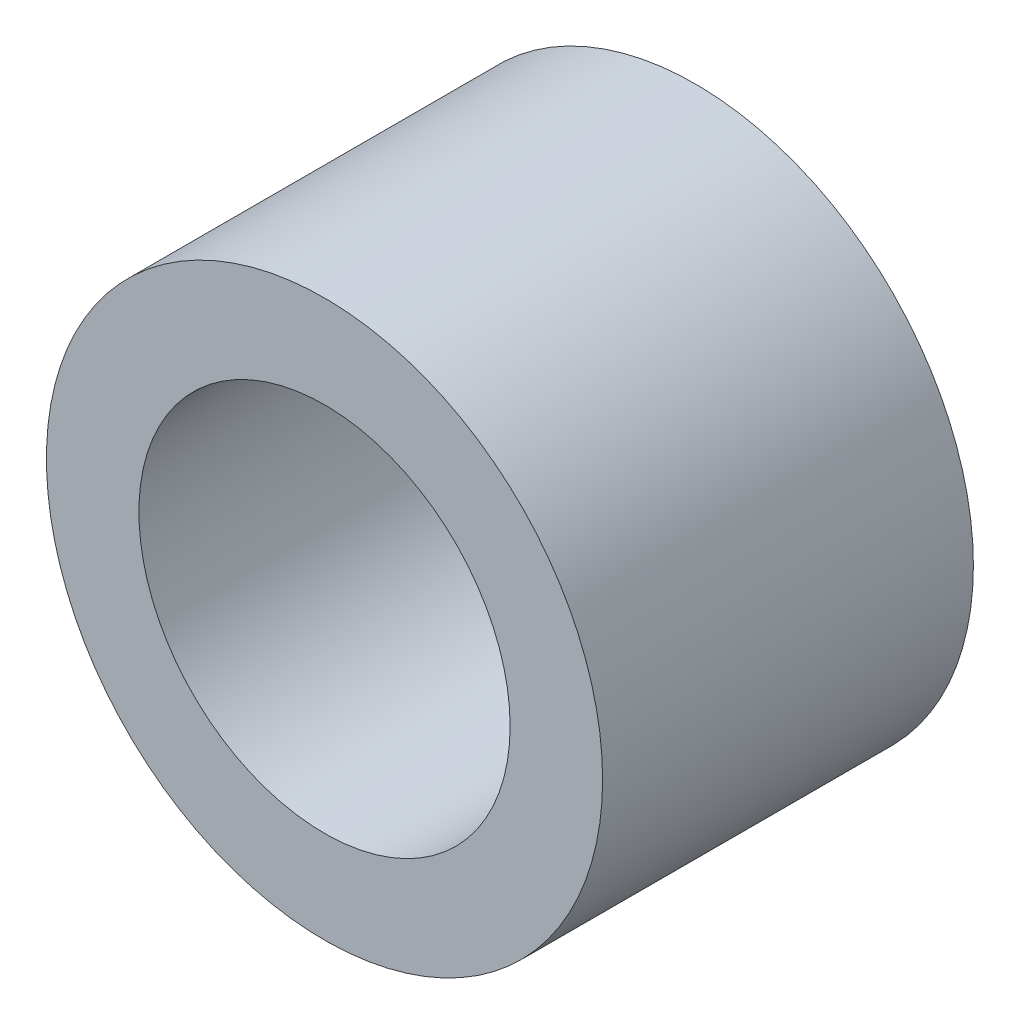
ISO-10303-21;
HEADER;
FILE_DESCRIPTION(('STEP AP214'),'2;1');
FILE_NAME('part.step','',(''),(''),'','','');
FILE_SCHEMA(('AUTOMOTIVE_DESIGN { 1 0 10303 214 1 1 1 1 }'));
ENDSEC;
DATA;
#1=APPLICATION_CONTEXT('core data for automotive mechanical design processes');
#2=APPLICATION_PROTOCOL_DEFINITION('international standard','automotive_design',2000,#1);
#3=PRODUCT_CONTEXT('',#1,'mechanical');
#4=PRODUCT('Part','Part','',(#3));
#5=PRODUCT_RELATED_PRODUCT_CATEGORY('part','',(#4));
#6=PRODUCT_DEFINITION_FORMATION('','',#4);
#7=PRODUCT_DEFINITION_CONTEXT('part definition',#1,'design');
#8=PRODUCT_DEFINITION('design','',#6,#7);
#9=PRODUCT_DEFINITION_SHAPE('','',#8);
#10=(LENGTH_UNIT() NAMED_UNIT(*) SI_UNIT(.MILLI.,.METRE.));
#11=(NAMED_UNIT(*) PLANE_ANGLE_UNIT() SI_UNIT($,.RADIAN.));
#12=(NAMED_UNIT(*) SI_UNIT($,.STERADIAN.) SOLID_ANGLE_UNIT());
#13=UNCERTAINTY_MEASURE_WITH_UNIT(LENGTH_MEASURE(1.E-05),#10,'distance_accuracy_value','');
#14=(GEOMETRIC_REPRESENTATION_CONTEXT(3) GLOBAL_UNCERTAINTY_ASSIGNED_CONTEXT((#13)) GLOBAL_UNIT_ASSIGNED_CONTEXT((#10,
#11,#12)) REPRESENTATION_CONTEXT('',''));
#15=CARTESIAN_POINT('',(0.,0.,0.));
#16=DIRECTION('',(0.,0.,1.));
#17=DIRECTION('',(1.,0.,0.));
#18=AXIS2_PLACEMENT_3D('',#15,#16,#17);
#19=CARTESIAN_POINT('',(0.,0.,-3.175));
#20=DIRECTION('',(0.,0.,1.));
#21=DIRECTION('',(1.,0.,0.));
#22=AXIS2_PLACEMENT_3D('',#19,#20,#21);
#23=CYLINDRICAL_SURFACE('',#22,4.7625);
#24=CARTESIAN_POINT('',(0.,0.,-3.175));
#25=DIRECTION('',(0.,0.,1.));
#26=DIRECTION('',(1.,0.,0.));
#27=AXIS2_PLACEMENT_3D('',#24,#25,#26);
#28=CIRCLE('',#27,4.7625);
#29=CARTESIAN_POINT('',(4.7625,0.,-3.175));
#30=VERTEX_POINT('',#29);
#31=EDGE_CURVE('E10',#30,#30,#28,.T.);
#32=ORIENTED_EDGE('',*,*,#31,.T.);
#33=EDGE_LOOP('',(#32));
#34=FACE_BOUND('',#33,.T.);
#35=CARTESIAN_POINT('',(0.,0.,3.175));
#36=DIRECTION('',(0.,0.,1.));
#37=DIRECTION('',(1.,0.,0.));
#38=AXIS2_PLACEMENT_3D('',#35,#36,#37);
#39=CIRCLE('',#38,4.7625);
#40=CARTESIAN_POINT('',(4.7625,0.,3.175));
#41=VERTEX_POINT('',#40);
#42=EDGE_CURVE('E47',#41,#41,#39,.T.);
#43=ORIENTED_EDGE('',*,*,#42,.F.);
#44=EDGE_LOOP('',(#43));
#45=FACE_BOUND('',#44,.T.);
#46=ADVANCED_FACE('F37',(#34,#45),#23,.T.);
#47=CARTESIAN_POINT('',(0.,0.,-3.175));
#48=DIRECTION('',(0.,0.,1.));
#49=DIRECTION('',(1.,0.,0.));
#50=AXIS2_PLACEMENT_3D('',#47,#48,#49);
#51=PLANE('',#50);
#52=CARTESIAN_POINT('',(0.,0.,-3.175));
#53=DIRECTION('',(0.,0.,1.));
#54=DIRECTION('',(1.,0.,0.));
#55=AXIS2_PLACEMENT_3D('',#52,#53,#54);
#56=CIRCLE('',#55,3.17881);
#57=CARTESIAN_POINT('',(3.17881,0.,-3.175));
#58=VERTEX_POINT('',#57);
#59=EDGE_CURVE('E43',#58,#58,#56,.T.);
#60=ORIENTED_EDGE('',*,*,#59,.T.);
#61=EDGE_LOOP('',(#60));
#62=FACE_BOUND('',#61,.T.);
#63=ORIENTED_EDGE('',*,*,#31,.F.);
#64=EDGE_LOOP('',(#63));
#65=FACE_BOUND('',#64,.T.);
#66=ADVANCED_FACE('F66',(#62,#65),#51,.F.);
#67=CARTESIAN_POINT('',(0.,0.,-3.175));
#68=DIRECTION('',(0.,0.,1.));
#69=DIRECTION('',(1.,0.,0.));
#70=AXIS2_PLACEMENT_3D('',#67,#68,#69);
#71=CYLINDRICAL_SURFACE('',#70,3.17881);
#72=ORIENTED_EDGE('',*,*,#59,.F.);
#73=EDGE_LOOP('',(#72));
#74=FACE_BOUND('',#73,.T.);
#75=CARTESIAN_POINT('',(0.,0.,3.175));
#76=DIRECTION('',(0.,0.,1.));
#77=DIRECTION('',(1.,0.,0.));
#78=AXIS2_PLACEMENT_3D('',#75,#76,#77);
#79=CIRCLE('',#78,3.17881);
#80=CARTESIAN_POINT('',(3.17881,0.,3.175));
#81=VERTEX_POINT('',#80);
#82=EDGE_CURVE('E51',#81,#81,#79,.T.);
#83=ORIENTED_EDGE('',*,*,#82,.T.);
#84=EDGE_LOOP('',(#83));
#85=FACE_BOUND('',#84,.T.);
#86=ADVANCED_FACE('F57',(#74,#85),#71,.F.);
#87=CARTESIAN_POINT('',(0.,0.,3.175));
#88=DIRECTION('',(0.,0.,1.));
#89=DIRECTION('',(1.,0.,0.));
#90=AXIS2_PLACEMENT_3D('',#87,#88,#89);
#91=PLANE('',#90);
#92=ORIENTED_EDGE('',*,*,#42,.T.);
#93=EDGE_LOOP('',(#92));
#94=FACE_BOUND('',#93,.T.);
#95=ORIENTED_EDGE('',*,*,#82,.F.);
#96=EDGE_LOOP('',(#95));
#97=FACE_BOUND('',#96,.T.);
#98=ADVANCED_FACE('F59',(#94,#97),#91,.T.);
#99=CLOSED_SHELL('',(#46,#66,#86,#98));
#100=MANIFOLD_SOLID_BREP('B2',#99);
#101=ADVANCED_BREP_SHAPE_REPRESENTATION('',(#18,#100),#14);
#102=SHAPE_DEFINITION_REPRESENTATION(#9,#101);
ENDSEC;
END-ISO-10303-21;
